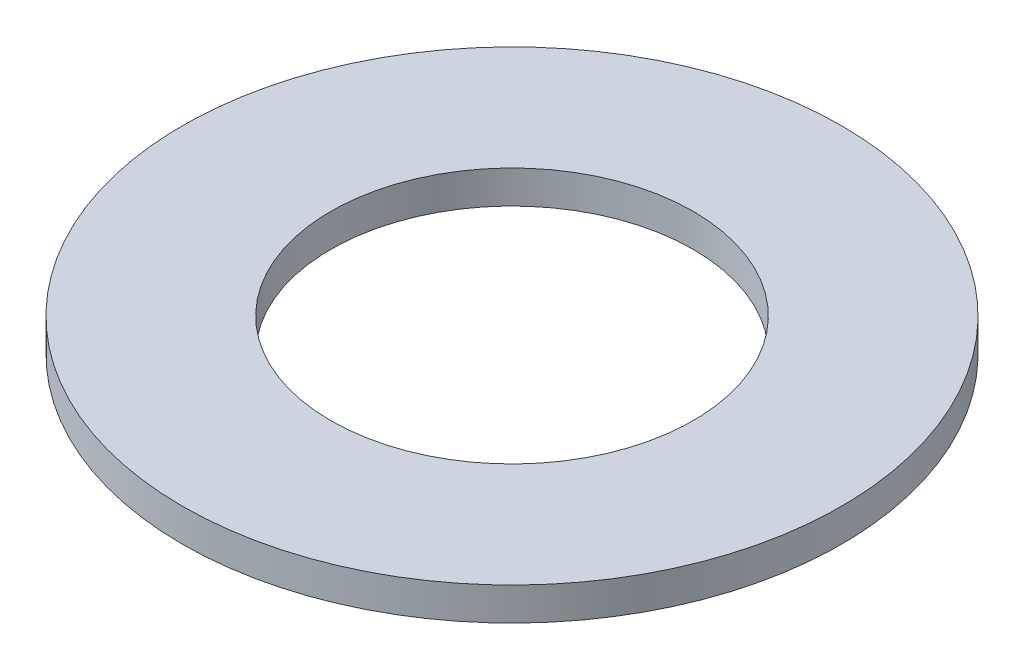
ISO-10303-21;
HEADER;
FILE_DESCRIPTION(('STEP AP214'),'2;1');
FILE_NAME('part.step','',(''),(''),'','','');
FILE_SCHEMA(('AUTOMOTIVE_DESIGN { 1 0 10303 214 1 1 1 1 }'));
ENDSEC;
DATA;
#1=APPLICATION_CONTEXT('core data for automotive mechanical design processes');
#2=APPLICATION_PROTOCOL_DEFINITION('international standard','automotive_design',2000,#1);
#3=PRODUCT_CONTEXT('',#1,'mechanical');
#4=PRODUCT('Part','Part','',(#3));
#5=PRODUCT_RELATED_PRODUCT_CATEGORY('part','',(#4));
#6=PRODUCT_DEFINITION_FORMATION('','',#4);
#7=PRODUCT_DEFINITION_CONTEXT('part definition',#1,'design');
#8=PRODUCT_DEFINITION('design','',#6,#7);
#9=PRODUCT_DEFINITION_SHAPE('','',#8);
#10=(LENGTH_UNIT() NAMED_UNIT(*) SI_UNIT(.MILLI.,.METRE.));
#11=(NAMED_UNIT(*) PLANE_ANGLE_UNIT() SI_UNIT($,.RADIAN.));
#12=(NAMED_UNIT(*) SI_UNIT($,.STERADIAN.) SOLID_ANGLE_UNIT());
#13=UNCERTAINTY_MEASURE_WITH_UNIT(LENGTH_MEASURE(1.E-05),#10,'distance_accuracy_value','');
#14=(GEOMETRIC_REPRESENTATION_CONTEXT(3) GLOBAL_UNCERTAINTY_ASSIGNED_CONTEXT((#13)) GLOBAL_UNIT_ASSIGNED_CONTEXT((#10,
#11,#12)) REPRESENTATION_CONTEXT('',''));
#15=CARTESIAN_POINT('',(0.,0.,0.));
#16=DIRECTION('',(0.,0.,1.));
#17=DIRECTION('',(1.,0.,0.));
#18=AXIS2_PLACEMENT_3D('',#15,#16,#17);
#19=CARTESIAN_POINT('',(0.,1.,0.));
#20=DIRECTION('',(0.,1.,0.));
#21=DIRECTION('',(0.,0.,1.));
#22=AXIS2_PLACEMENT_3D('',#19,#20,#21);
#23=PLANE('',#22);
#24=CARTESIAN_POINT('',(0.,1.,0.));
#25=DIRECTION('',(0.,1.,0.));
#26=DIRECTION('',(0.,0.,1.));
#27=AXIS2_PLACEMENT_3D('',#24,#25,#26);
#28=CIRCLE('',#27,10.);
#29=CARTESIAN_POINT('',(0.,1.,10.));
#30=VERTEX_POINT('',#29);
#31=EDGE_CURVE('E10',#30,#30,#28,.T.);
#32=ORIENTED_EDGE('',*,*,#31,.T.);
#33=EDGE_LOOP('',(#32));
#34=FACE_BOUND('',#33,.T.);
#35=CARTESIAN_POINT('',(0.,1.,0.));
#36=DIRECTION('',(0.,1.,0.));
#37=DIRECTION('',(0.,0.,1.));
#38=AXIS2_PLACEMENT_3D('',#35,#36,#37);
#39=CIRCLE('',#38,5.5);
#40=CARTESIAN_POINT('',(0.,1.,5.5));
#41=VERTEX_POINT('',#40);
#42=EDGE_CURVE('E50',#41,#41,#39,.T.);
#43=ORIENTED_EDGE('',*,*,#42,.F.);
#44=EDGE_LOOP('',(#43));
#45=FACE_BOUND('',#44,.T.);
#46=ADVANCED_FACE('F37',(#34,#45),#23,.T.);
#47=CARTESIAN_POINT('',(0.,0.,0.));
#48=DIRECTION('',(0.,1.,0.));
#49=DIRECTION('',(0.,0.,1.));
#50=AXIS2_PLACEMENT_3D('',#47,#48,#49);
#51=PLANE('',#50);
#52=CARTESIAN_POINT('',(0.,0.,0.));
#53=DIRECTION('',(0.,1.,0.));
#54=DIRECTION('',(0.,0.,1.));
#55=AXIS2_PLACEMENT_3D('',#52,#53,#54);
#56=CIRCLE('',#55,10.);
#57=CARTESIAN_POINT('',(0.,0.,10.));
#58=VERTEX_POINT('',#57);
#59=EDGE_CURVE('E41',#58,#58,#56,.T.);
#60=ORIENTED_EDGE('',*,*,#59,.F.);
#61=EDGE_LOOP('',(#60));
#62=FACE_BOUND('',#61,.T.);
#63=CARTESIAN_POINT('',(0.,0.,0.));
#64=DIRECTION('',(0.,1.,0.));
#65=DIRECTION('',(0.,0.,1.));
#66=AXIS2_PLACEMENT_3D('',#63,#64,#65);
#67=CIRCLE('',#66,5.5);
#68=CARTESIAN_POINT('',(0.,0.,5.5));
#69=VERTEX_POINT('',#68);
#70=EDGE_CURVE('E52',#69,#69,#67,.T.);
#71=ORIENTED_EDGE('',*,*,#70,.T.);
#72=EDGE_LOOP('',(#71));
#73=FACE_BOUND('',#72,.T.);
#74=ADVANCED_FACE('F64',(#62,#73),#51,.F.);
#75=CARTESIAN_POINT('',(0.,1.,0.));
#76=DIRECTION('',(0.,-1.,0.));
#77=DIRECTION('',(0.,0.,-1.));
#78=AXIS2_PLACEMENT_3D('',#75,#76,#77);
#79=CYLINDRICAL_SURFACE('',#78,10.);
#80=ORIENTED_EDGE('',*,*,#31,.F.);
#81=EDGE_LOOP('',(#80));
#82=FACE_BOUND('',#81,.T.);
#83=ORIENTED_EDGE('',*,*,#59,.T.);
#84=EDGE_LOOP('',(#83));
#85=FACE_BOUND('',#84,.T.);
#86=ADVANCED_FACE('F39',(#82,#85),#79,.T.);
#87=CARTESIAN_POINT('',(0.,1.,0.));
#88=DIRECTION('',(0.,-1.,0.));
#89=DIRECTION('',(0.,0.,-1.));
#90=AXIS2_PLACEMENT_3D('',#87,#88,#89);
#91=CYLINDRICAL_SURFACE('',#90,5.5);
#92=ORIENTED_EDGE('',*,*,#42,.T.);
#93=EDGE_LOOP('',(#92));
#94=FACE_BOUND('',#93,.T.);
#95=ORIENTED_EDGE('',*,*,#70,.F.);
#96=EDGE_LOOP('',(#95));
#97=FACE_BOUND('',#96,.T.);
#98=ADVANCED_FACE('F60',(#94,#97),#91,.F.);
#99=CLOSED_SHELL('',(#46,#74,#86,#98));
#100=MANIFOLD_SOLID_BREP('B2',#99);
#101=ADVANCED_BREP_SHAPE_REPRESENTATION('',(#18,#100),#14);
#102=SHAPE_DEFINITION_REPRESENTATION(#9,#101);
ENDSEC;
END-ISO-10303-21;
